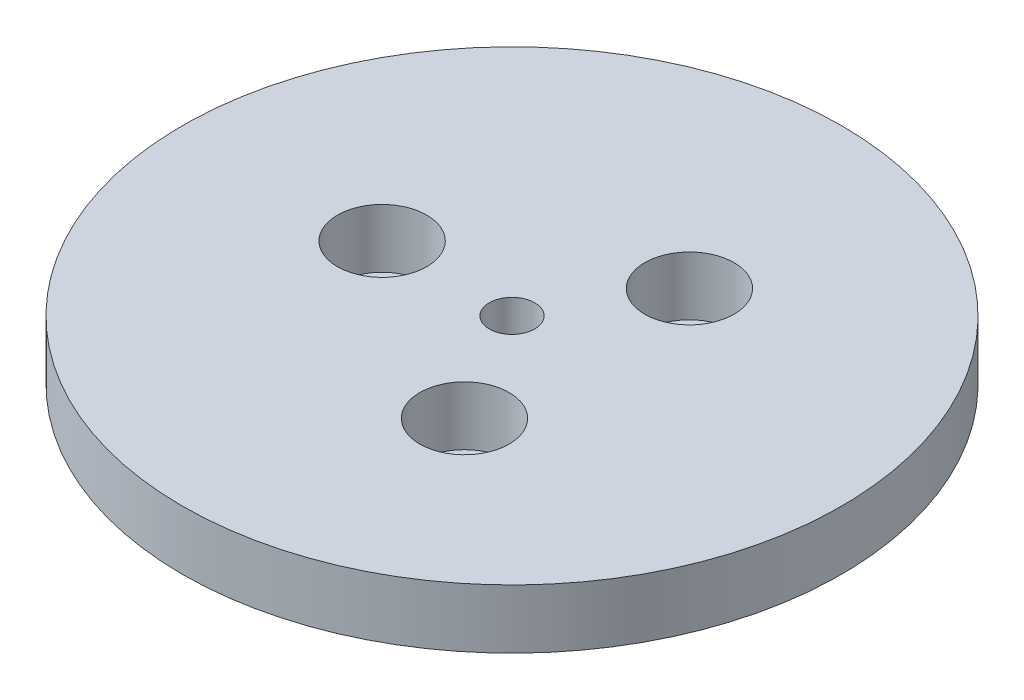
ISO-10303-21;
HEADER;
FILE_DESCRIPTION(('STEP AP214'),'2;1');
FILE_NAME('part.step','',(''),(''),'','','');
FILE_SCHEMA(('AUTOMOTIVE_DESIGN { 1 0 10303 214 1 1 1 1 }'));
ENDSEC;
DATA;
#1=APPLICATION_CONTEXT('core data for automotive mechanical design processes');
#2=APPLICATION_PROTOCOL_DEFINITION('international standard','automotive_design',2000,#1);
#3=PRODUCT_CONTEXT('',#1,'mechanical');
#4=PRODUCT('Part','Part','',(#3));
#5=PRODUCT_RELATED_PRODUCT_CATEGORY('part','',(#4));
#6=PRODUCT_DEFINITION_FORMATION('','',#4);
#7=PRODUCT_DEFINITION_CONTEXT('part definition',#1,'design');
#8=PRODUCT_DEFINITION('design','',#6,#7);
#9=PRODUCT_DEFINITION_SHAPE('','',#8);
#10=(LENGTH_UNIT() NAMED_UNIT(*) SI_UNIT(.MILLI.,.METRE.));
#11=(NAMED_UNIT(*) PLANE_ANGLE_UNIT() SI_UNIT($,.RADIAN.));
#12=(NAMED_UNIT(*) SI_UNIT($,.STERADIAN.) SOLID_ANGLE_UNIT());
#13=UNCERTAINTY_MEASURE_WITH_UNIT(LENGTH_MEASURE(1.E-05),#10,'distance_accuracy_value','');
#14=(GEOMETRIC_REPRESENTATION_CONTEXT(3) GLOBAL_UNCERTAINTY_ASSIGNED_CONTEXT((#13)) GLOBAL_UNIT_ASSIGNED_CONTEXT((#10,
#11,#12)) REPRESENTATION_CONTEXT('',''));
#15=CARTESIAN_POINT('',(0.,0.,0.));
#16=DIRECTION('',(0.,0.,1.));
#17=DIRECTION('',(1.,0.,0.));
#18=AXIS2_PLACEMENT_3D('',#15,#16,#17);
#19=CARTESIAN_POINT('',(0.,13.,0.));
#20=DIRECTION('',(0.,-1.,0.));
#21=DIRECTION('',(0.,0.,-1.));
#22=AXIS2_PLACEMENT_3D('',#19,#20,#21);
#23=CYLINDRICAL_SURFACE('',#22,72.5);
#24=CARTESIAN_POINT('',(0.,13.,0.));
#25=DIRECTION('',(0.,1.,0.));
#26=DIRECTION('',(0.,0.,1.));
#27=AXIS2_PLACEMENT_3D('',#24,#25,#26);
#28=CIRCLE('',#27,72.5);
#29=CARTESIAN_POINT('',(0.,13.,-72.5));
#30=VERTEX_POINT('',#29);
#31=EDGE_CURVE('E10',#30,#30,#28,.T.);
#32=CARTESIAN_POINT('',(0.,0.,0.));
#33=DIRECTION('',(0.,1.,0.));
#34=DIRECTION('',(0.,0.,1.));
#35=AXIS2_PLACEMENT_3D('',#32,#33,#34);
#36=CIRCLE('',#35,72.5);
#37=CARTESIAN_POINT('',(0.,0.,-72.5));
#38=VERTEX_POINT('',#37);
#39=EDGE_CURVE('E37',#38,#38,#36,.T.);
#40=CARTESIAN_POINT('',(0.,13.,-72.5));
#41=CARTESIAN_POINT('',(0.,12.8645833333333,-72.5));
#42=CARTESIAN_POINT('',(0.,12.7291666666667,-72.5));
#43=CARTESIAN_POINT('',(0.,12.4583333333333,-72.5));
#44=CARTESIAN_POINT('',(0.,12.3229166666667,-72.5));
#45=CARTESIAN_POINT('',(0.,12.0520833333333,-72.5));
#46=CARTESIAN_POINT('',(0.,11.9166666666667,-72.5));
#47=CARTESIAN_POINT('',(0.,11.6458333333333,-72.5));
#48=CARTESIAN_POINT('',(0.,11.5104166666667,-72.5));
#49=CARTESIAN_POINT('',(0.,11.2395833333333,-72.5));
#50=CARTESIAN_POINT('',(0.,11.1041666666667,-72.5));
#51=CARTESIAN_POINT('',(0.,10.8333333333333,-72.5));
#52=CARTESIAN_POINT('',(0.,10.6979166666667,-72.5));
#53=CARTESIAN_POINT('',(0.,10.4270833333333,-72.5));
#54=CARTESIAN_POINT('',(0.,10.2916666666667,-72.5));
#55=CARTESIAN_POINT('',(0.,10.0208333333333,-72.5));
#56=CARTESIAN_POINT('',(0.,9.88541666666667,-72.5));
#57=CARTESIAN_POINT('',(0.,9.61458333333333,-72.5));
#58=CARTESIAN_POINT('',(0.,9.47916666666667,-72.5));
#59=CARTESIAN_POINT('',(0.,9.20833333333333,-72.5));
#60=CARTESIAN_POINT('',(0.,9.07291666666666,-72.5));
#61=CARTESIAN_POINT('',(0.,8.80208333333333,-72.5));
#62=CARTESIAN_POINT('',(0.,8.66666666666667,-72.5));
#63=CARTESIAN_POINT('',(0.,8.39583333333333,-72.5));
#64=CARTESIAN_POINT('',(0.,8.26041666666667,-72.5));
#65=CARTESIAN_POINT('',(0.,7.98958333333333,-72.5));
#66=CARTESIAN_POINT('',(0.,7.85416666666667,-72.5));
#67=CARTESIAN_POINT('',(0.,7.58333333333333,-72.5));
#68=CARTESIAN_POINT('',(0.,7.44791666666667,-72.5));
#69=CARTESIAN_POINT('',(0.,7.17708333333333,-72.5));
#70=CARTESIAN_POINT('',(0.,7.04166666666667,-72.5));
#71=CARTESIAN_POINT('',(0.,6.77083333333333,-72.5));
#72=CARTESIAN_POINT('',(0.,6.63541666666667,-72.5));
#73=CARTESIAN_POINT('',(0.,6.36458333333333,-72.5));
#74=CARTESIAN_POINT('',(0.,6.22916666666667,-72.5));
#75=CARTESIAN_POINT('',(0.,5.95833333333333,-72.5));
#76=CARTESIAN_POINT('',(0.,5.82291666666667,-72.5));
#77=CARTESIAN_POINT('',(0.,5.55208333333333,-72.5));
#78=CARTESIAN_POINT('',(0.,5.41666666666667,-72.5));
#79=CARTESIAN_POINT('',(0.,5.14583333333333,-72.5));
#80=CARTESIAN_POINT('',(0.,5.01041666666667,-72.5));
#81=CARTESIAN_POINT('',(0.,4.73958333333333,-72.5));
#82=CARTESIAN_POINT('',(0.,4.60416666666667,-72.5));
#83=CARTESIAN_POINT('',(0.,4.33333333333333,-72.5));
#84=CARTESIAN_POINT('',(0.,4.19791666666667,-72.5));
#85=CARTESIAN_POINT('',(0.,3.92708333333333,-72.5));
#86=CARTESIAN_POINT('',(0.,3.79166666666667,-72.5));
#87=CARTESIAN_POINT('',(0.,3.52083333333333,-72.5));
#88=CARTESIAN_POINT('',(0.,3.38541666666667,-72.5));
#89=CARTESIAN_POINT('',(0.,3.11458333333333,-72.5));
#90=CARTESIAN_POINT('',(0.,2.97916666666667,-72.5));
#91=CARTESIAN_POINT('',(0.,2.70833333333333,-72.5));
#92=CARTESIAN_POINT('',(0.,2.57291666666667,-72.5));
#93=CARTESIAN_POINT('',(0.,2.30208333333333,-72.5));
#94=CARTESIAN_POINT('',(0.,2.16666666666667,-72.5));
#95=CARTESIAN_POINT('',(0.,1.89583333333333,-72.5));
#96=CARTESIAN_POINT('',(0.,1.76041666666667,-72.5));
#97=CARTESIAN_POINT('',(0.,1.48958333333333,-72.5));
#98=CARTESIAN_POINT('',(0.,1.35416666666667,-72.5));
#99=CARTESIAN_POINT('',(0.,1.08333333333333,-72.5));
#100=CARTESIAN_POINT('',(0.,0.947916666666667,-72.5));
#101=CARTESIAN_POINT('',(0.,0.677083333333334,-72.5));
#102=CARTESIAN_POINT('',(0.,0.541666666666667,-72.5));
#103=CARTESIAN_POINT('',(0.,0.270833333333334,-72.5));
#104=CARTESIAN_POINT('',(0.,0.135416666666667,-72.5));
#105=CARTESIAN_POINT('',(0.,0.,-72.5));
#106=B_SPLINE_CURVE_WITH_KNOTS('',3,(#40,#41,#42,#43,#44,#45,#46,#47,#48,#49,#50,#51,#52,#53,
#54,#55,#56,#57,#58,#59,#60,#61,#62,#63,#64,#65,#66,#67,#68,#69,#70,#71,#72,#73,#74,#75,#76,#77,
#78,#79,#80,#81,#82,#83,#84,#85,#86,#87,#88,#89,#90,#91,#92,#93,#94,#95,#96,#97,#98,#99,#100,
#101,#102,#103,#104,#105),.UNSPECIFIED.,.F.,.F.,(4,2,2,2,2,2,2,2,2,2,2,2,2,2,2,2,2,2,2,2,2,2,2,
2,2,2,2,2,2,2,2,2,4),(0.,0.40625,0.812500000000001,1.21875,1.625,2.03125,2.4375,2.84375,3.25,
3.65625,4.0625,4.46875,4.875,5.28125,5.6875,6.09375,6.5,6.90625,7.3125,7.71875,8.125,8.53125,
8.9375,9.34375,9.75,10.15625,10.5625,10.96875,11.375,11.78125,12.1875,12.59375,13.),.UNSPECIFIED.);
#107=EDGE_CURVE('BSEAM40',#30,#38,#106,.T.);
#108=ORIENTED_EDGE('',*,*,#31,.F.);
#109=ORIENTED_EDGE('',*,*,#39,.T.);
#110=ORIENTED_EDGE('',*,*,#107,.T.);
#111=ORIENTED_EDGE('',*,*,#107,.F.);
#112=EDGE_LOOP('',(#108,#110,#109,#111));
#113=FACE_BOUND('',#112,.T.);
#114=ADVANCED_FACE('F40',(#113),#23,.T.);
#115=CARTESIAN_POINT('',(0.,13.,0.));
#116=DIRECTION('',(0.,1.,0.));
#117=DIRECTION('',(0.,0.,1.));
#118=AXIS2_PLACEMENT_3D('',#115,#116,#117);
#119=PLANE('',#118);
#120=CARTESIAN_POINT('',(14.2865340298328,13.,24.7450028037318));
#121=DIRECTION('',(0.,1.,0.));
#122=DIRECTION('',(0.866025403784436,0.,-0.500000000000004));
#123=AXIS2_PLACEMENT_3D('',#120,#121,#122);
#124=CIRCLE('',#123,9.83083954341194);
#125=CARTESIAN_POINT('',(22.8002908149561,13.,19.8295830320258));
#126=VERTEX_POINT('',#125);
#127=EDGE_CURVE('E70',#126,#126,#124,.T.);
#128=ORIENTED_EDGE('',*,*,#127,.F.);
#129=EDGE_LOOP('',(#128));
#130=FACE_BOUND('',#129,.T.);
#131=CARTESIAN_POINT('',(14.2865340298324,13.,-24.745002803732));
#132=DIRECTION('',(0.,1.,0.));
#133=DIRECTION('',(-0.866025403784443,0.,-0.499999999999992));
#134=AXIS2_PLACEMENT_3D('',#131,#132,#133);
#135=CIRCLE('',#134,9.83083954341194);
#136=CARTESIAN_POINT('',(5.77277724470902,13.,-29.6604225754379));
#137=VERTEX_POINT('',#136);
#138=EDGE_CURVE('E61',#137,#137,#135,.T.);
#139=ORIENTED_EDGE('',*,*,#138,.F.);
#140=EDGE_LOOP('',(#139));
#141=FACE_BOUND('',#140,.T.);
#142=CARTESIAN_POINT('',(-28.5730680596653,13.,0.));
#143=DIRECTION('',(0.,1.,0.));
#144=DIRECTION('',(0.,0.,1.));
#145=AXIS2_PLACEMENT_3D('',#142,#143,#144);
#146=CIRCLE('',#145,9.83083954341194);
#147=CARTESIAN_POINT('',(-28.5730680596653,13.,9.83083954341194));
#148=VERTEX_POINT('',#147);
#149=EDGE_CURVE('E54',#148,#148,#146,.T.);
#150=ORIENTED_EDGE('',*,*,#149,.F.);
#151=EDGE_LOOP('',(#150));
#152=FACE_BOUND('',#151,.T.);
#153=CARTESIAN_POINT('',(0.,13.,0.));
#154=DIRECTION('',(0.,1.,0.));
#155=DIRECTION('',(0.,0.,1.));
#156=AXIS2_PLACEMENT_3D('',#153,#154,#155);
#157=CIRCLE('',#156,5.);
#158=CARTESIAN_POINT('',(0.,13.,-5.));
#159=VERTEX_POINT('',#158);
#160=EDGE_CURVE('E50',#159,#159,#157,.T.);
#161=ORIENTED_EDGE('',*,*,#160,.F.);
#162=EDGE_LOOP('',(#161));
#163=FACE_BOUND('',#162,.T.);
#164=ORIENTED_EDGE('',*,*,#31,.T.);
#165=EDGE_LOOP('',(#164));
#166=FACE_BOUND('',#165,.T.);
#167=ADVANCED_FACE('F85',(#130,#141,#152,#163,#166),#119,.T.);
#168=CARTESIAN_POINT('',(0.,0.,0.));
#169=DIRECTION('',(0.,1.,0.));
#170=DIRECTION('',(0.,0.,1.));
#171=AXIS2_PLACEMENT_3D('',#168,#169,#170);
#172=PLANE('',#171);
#173=CARTESIAN_POINT('',(0.,0.,0.));
#174=DIRECTION('',(0.,1.,0.));
#175=DIRECTION('',(0.,0.,1.));
#176=AXIS2_PLACEMENT_3D('',#173,#174,#175);
#177=CIRCLE('',#176,5.);
#178=CARTESIAN_POINT('',(0.,0.,-5.));
#179=VERTEX_POINT('',#178);
#180=EDGE_CURVE('E47',#179,#179,#177,.T.);
#181=ORIENTED_EDGE('',*,*,#180,.T.);
#182=EDGE_LOOP('',(#181));
#183=FACE_BOUND('',#182,.T.);
#184=ORIENTED_EDGE('',*,*,#39,.F.);
#185=EDGE_LOOP('',(#184));
#186=FACE_BOUND('',#185,.T.);
#187=ADVANCED_FACE('F84',(#183,#186),#172,.F.);
#188=CARTESIAN_POINT('',(0.,13.,0.));
#189=DIRECTION('',(0.,-1.,0.));
#190=DIRECTION('',(0.,0.,-1.));
#191=AXIS2_PLACEMENT_3D('',#188,#189,#190);
#192=CYLINDRICAL_SURFACE('',#191,5.);
#193=CARTESIAN_POINT('',(0.,13.,-5.));
#194=CARTESIAN_POINT('',(0.,12.8645833333333,-5.));
#195=CARTESIAN_POINT('',(0.,12.7291666666667,-5.));
#196=CARTESIAN_POINT('',(0.,12.4583333333333,-5.));
#197=CARTESIAN_POINT('',(0.,12.3229166666667,-5.));
#198=CARTESIAN_POINT('',(0.,12.0520833333333,-5.));
#199=CARTESIAN_POINT('',(0.,11.9166666666667,-5.));
#200=CARTESIAN_POINT('',(0.,11.6458333333333,-5.));
#201=CARTESIAN_POINT('',(0.,11.5104166666667,-5.));
#202=CARTESIAN_POINT('',(0.,11.2395833333333,-5.));
#203=CARTESIAN_POINT('',(0.,11.1041666666667,-5.));
#204=CARTESIAN_POINT('',(0.,10.8333333333333,-5.));
#205=CARTESIAN_POINT('',(0.,10.6979166666667,-5.));
#206=CARTESIAN_POINT('',(0.,10.4270833333333,-5.));
#207=CARTESIAN_POINT('',(0.,10.2916666666667,-5.));
#208=CARTESIAN_POINT('',(0.,10.0208333333333,-5.));
#209=CARTESIAN_POINT('',(0.,9.88541666666667,-5.));
#210=CARTESIAN_POINT('',(0.,9.61458333333333,-5.));
#211=CARTESIAN_POINT('',(0.,9.47916666666667,-5.));
#212=CARTESIAN_POINT('',(0.,9.20833333333333,-5.));
#213=CARTESIAN_POINT('',(0.,9.07291666666667,-5.));
#214=CARTESIAN_POINT('',(0.,8.80208333333333,-5.));
#215=CARTESIAN_POINT('',(0.,8.66666666666667,-5.));
#216=CARTESIAN_POINT('',(0.,8.39583333333333,-5.));
#217=CARTESIAN_POINT('',(0.,8.26041666666667,-5.));
#218=CARTESIAN_POINT('',(0.,7.98958333333333,-5.));
#219=CARTESIAN_POINT('',(0.,7.85416666666667,-5.));
#220=CARTESIAN_POINT('',(0.,7.58333333333333,-5.));
#221=CARTESIAN_POINT('',(0.,7.44791666666667,-5.));
#222=CARTESIAN_POINT('',(0.,7.17708333333333,-5.));
#223=CARTESIAN_POINT('',(0.,7.04166666666667,-5.));
#224=CARTESIAN_POINT('',(0.,6.77083333333333,-5.));
#225=CARTESIAN_POINT('',(0.,6.63541666666667,-5.));
#226=CARTESIAN_POINT('',(0.,6.36458333333333,-5.));
#227=CARTESIAN_POINT('',(0.,6.22916666666667,-5.));
#228=CARTESIAN_POINT('',(0.,5.95833333333333,-5.));
#229=CARTESIAN_POINT('',(0.,5.82291666666667,-5.));
#230=CARTESIAN_POINT('',(0.,5.55208333333333,-5.));
#231=CARTESIAN_POINT('',(0.,5.41666666666667,-5.));
#232=CARTESIAN_POINT('',(0.,5.14583333333333,-5.));
#233=CARTESIAN_POINT('',(0.,5.01041666666667,-5.));
#234=CARTESIAN_POINT('',(0.,4.73958333333333,-5.));
#235=CARTESIAN_POINT('',(0.,4.60416666666667,-5.));
#236=CARTESIAN_POINT('',(0.,4.33333333333333,-5.));
#237=CARTESIAN_POINT('',(0.,4.19791666666667,-5.));
#238=CARTESIAN_POINT('',(0.,3.92708333333333,-5.));
#239=CARTESIAN_POINT('',(0.,3.79166666666667,-5.));
#240=CARTESIAN_POINT('',(0.,3.52083333333333,-5.));
#241=CARTESIAN_POINT('',(0.,3.38541666666667,-5.));
#242=CARTESIAN_POINT('',(0.,3.11458333333333,-5.));
#243=CARTESIAN_POINT('',(0.,2.97916666666667,-5.));
#244=CARTESIAN_POINT('',(0.,2.70833333333333,-5.));
#245=CARTESIAN_POINT('',(0.,2.57291666666667,-5.));
#246=CARTESIAN_POINT('',(0.,2.30208333333333,-5.));
#247=CARTESIAN_POINT('',(0.,2.16666666666667,-5.));
#248=CARTESIAN_POINT('',(0.,1.89583333333333,-5.));
#249=CARTESIAN_POINT('',(0.,1.76041666666667,-5.));
#250=CARTESIAN_POINT('',(0.,1.48958333333333,-5.));
#251=CARTESIAN_POINT('',(0.,1.35416666666667,-5.));
#252=CARTESIAN_POINT('',(0.,1.08333333333333,-5.));
#253=CARTESIAN_POINT('',(0.,0.947916666666667,-5.));
#254=CARTESIAN_POINT('',(0.,0.677083333333334,-5.));
#255=CARTESIAN_POINT('',(0.,0.541666666666667,-5.));
#256=CARTESIAN_POINT('',(0.,0.270833333333334,-5.));
#257=CARTESIAN_POINT('',(0.,0.135416666666667,-5.));
#258=CARTESIAN_POINT('',(0.,0.,-5.));
#259=B_SPLINE_CURVE_WITH_KNOTS('',3,(#193,#194,#195,#196,#197,#198,#199,#200,#201,#202,#203,
#204,#205,#206,#207,#208,#209,#210,#211,#212,#213,#214,#215,#216,#217,#218,#219,#220,#221,#222,
#223,#224,#225,#226,#227,#228,#229,#230,#231,#232,#233,#234,#235,#236,#237,#238,#239,#240,#241,
#242,#243,#244,#245,#246,#247,#248,#249,#250,#251,#252,#253,#254,#255,#256,#257,#258),
.UNSPECIFIED.,.F.,.F.,(4,2,2,2,2,2,2,2,2,2,2,2,2,2,2,2,2,2,2,2,2,2,2,2,2,2,2,2,2,2,2,2,4),(0.,
0.406249999999999,0.812499999999999,1.21875,1.625,2.03125,2.4375,2.84375,3.25,3.65625,4.0625,
4.46875,4.875,5.28125,5.6875,6.09375,6.5,6.90625,7.3125,7.71875,8.125,8.53125,8.9375,9.34375,
9.75,10.15625,10.5625,10.96875,11.375,11.78125,12.1875,12.59375,13.),.UNSPECIFIED.);
#260=EDGE_CURVE('BSEAM91',#159,#179,#259,.T.);
#261=ORIENTED_EDGE('',*,*,#160,.T.);
#262=ORIENTED_EDGE('',*,*,#180,.F.);
#263=ORIENTED_EDGE('',*,*,#260,.T.);
#264=ORIENTED_EDGE('',*,*,#260,.F.);
#265=EDGE_LOOP('',(#261,#263,#262,#264));
#266=FACE_BOUND('',#265,.T.);
#267=ADVANCED_FACE('F91',(#266),#192,.F.);
#268=CARTESIAN_POINT('',(-28.5730680596653,0.0742039949012813,0.));
#269=DIRECTION('',(0.,1.,0.));
#270=DIRECTION('',(0.,0.,1.));
#271=AXIS2_PLACEMENT_3D('',#268,#269,#270);
#272=CYLINDRICAL_SURFACE('',#271,9.83083954341194);
#273=CARTESIAN_POINT('',(-28.5730680596653,0.0742039949012813,0.));
#274=DIRECTION('',(0.,1.,0.));
#275=DIRECTION('',(0.,0.,1.));
#276=AXIS2_PLACEMENT_3D('',#273,#274,#275);
#277=CIRCLE('',#276,9.83083954341194);
#278=CARTESIAN_POINT('',(-28.5730680596653,0.0742039949012813,9.83083954341194));
#279=VERTEX_POINT('',#278);
#280=EDGE_CURVE('E55',#279,#279,#277,.T.);
#281=ORIENTED_EDGE('',*,*,#280,.F.);
#282=EDGE_LOOP('',(#281));
#283=FACE_BOUND('',#282,.T.);
#284=ORIENTED_EDGE('',*,*,#149,.T.);
#285=EDGE_LOOP('',(#284));
#286=FACE_BOUND('',#285,.T.);
#287=ADVANCED_FACE('F96',(#283,#286),#272,.F.);
#288=CARTESIAN_POINT('',(-28.5730680596653,0.0742039949012813,0.));
#289=DIRECTION('',(0.,1.,0.));
#290=DIRECTION('',(0.,0.,1.));
#291=AXIS2_PLACEMENT_3D('',#288,#289,#290);
#292=PLANE('',#291);
#293=ORIENTED_EDGE('',*,*,#280,.T.);
#294=EDGE_LOOP('',(#293));
#295=FACE_BOUND('',#294,.T.);
#296=ADVANCED_FACE('F127',(#295),#292,.T.);
#297=CARTESIAN_POINT('',(14.2865340298324,0.0742039949012813,-24.745002803732));
#298=DIRECTION('',(0.,1.,0.));
#299=DIRECTION('',(0.,0.,1.));
#300=AXIS2_PLACEMENT_3D('',#297,#298,#299);
#301=CYLINDRICAL_SURFACE('',#300,9.83083954341194);
#302=CARTESIAN_POINT('',(14.2865340298324,0.0742039949012813,-24.745002803732));
#303=DIRECTION('',(0.,1.,0.));
#304=DIRECTION('',(-0.866025403784443,0.,-0.499999999999992));
#305=AXIS2_PLACEMENT_3D('',#302,#303,#304);
#306=CIRCLE('',#305,9.83083954341194);
#307=CARTESIAN_POINT('',(5.77277724470902,0.0742039949012813,-29.6604225754379));
#308=VERTEX_POINT('',#307);
#309=EDGE_CURVE('E63',#308,#308,#306,.T.);
#310=ORIENTED_EDGE('',*,*,#309,.F.);
#311=EDGE_LOOP('',(#310));
#312=FACE_BOUND('',#311,.T.);
#313=ORIENTED_EDGE('',*,*,#138,.T.);
#314=EDGE_LOOP('',(#313));
#315=FACE_BOUND('',#314,.T.);
#316=ADVANCED_FACE('F133',(#312,#315),#301,.F.);
#317=CARTESIAN_POINT('',(14.2865340298324,0.0742039949012813,-24.745002803732));
#318=DIRECTION('',(0.,1.,0.));
#319=DIRECTION('',(-0.866025403784443,0.,-0.499999999999992));
#320=AXIS2_PLACEMENT_3D('',#317,#318,#319);
#321=PLANE('',#320);
#322=ORIENTED_EDGE('',*,*,#309,.T.);
#323=EDGE_LOOP('',(#322));
#324=FACE_BOUND('',#323,.T.);
#325=ADVANCED_FACE('F77',(#324),#321,.T.);
#326=CARTESIAN_POINT('',(14.2865340298328,0.0742039949012813,24.7450028037318));
#327=DIRECTION('',(0.,1.,0.));
#328=DIRECTION('',(0.,0.,1.));
#329=AXIS2_PLACEMENT_3D('',#326,#327,#328);
#330=CYLINDRICAL_SURFACE('',#329,9.83083954341194);
#331=CARTESIAN_POINT('',(14.2865340298328,0.0742039949012813,24.7450028037318));
#332=DIRECTION('',(0.,1.,0.));
#333=DIRECTION('',(0.866025403784436,0.,-0.500000000000004));
#334=AXIS2_PLACEMENT_3D('',#331,#332,#333);
#335=CIRCLE('',#334,9.83083954341194);
#336=CARTESIAN_POINT('',(22.8002908149561,0.0742039949012813,19.8295830320258));
#337=VERTEX_POINT('',#336);
#338=EDGE_CURVE('E59',#337,#337,#335,.T.);
#339=ORIENTED_EDGE('',*,*,#338,.F.);
#340=EDGE_LOOP('',(#339));
#341=FACE_BOUND('',#340,.T.);
#342=ORIENTED_EDGE('',*,*,#127,.T.);
#343=EDGE_LOOP('',(#342));
#344=FACE_BOUND('',#343,.T.);
#345=ADVANCED_FACE('F73',(#341,#344),#330,.F.);
#346=CARTESIAN_POINT('',(14.2865340298328,0.0742039949012813,24.7450028037318));
#347=DIRECTION('',(0.,1.,0.));
#348=DIRECTION('',(0.866025403784436,0.,-0.500000000000004));
#349=AXIS2_PLACEMENT_3D('',#346,#347,#348);
#350=PLANE('',#349);
#351=ORIENTED_EDGE('',*,*,#338,.T.);
#352=EDGE_LOOP('',(#351));
#353=FACE_BOUND('',#352,.T.);
#354=ADVANCED_FACE('F71',(#353),#350,.T.);
#355=CLOSED_SHELL('',(#114,#167,#187,#267,#287,#296,#316,#325,#345,#354));
#356=MANIFOLD_SOLID_BREP('B2',#355);
#357=ADVANCED_BREP_SHAPE_REPRESENTATION('',(#18,#356),#14);
#358=SHAPE_DEFINITION_REPRESENTATION(#9,#357);
ENDSEC;
END-ISO-10303-21;
